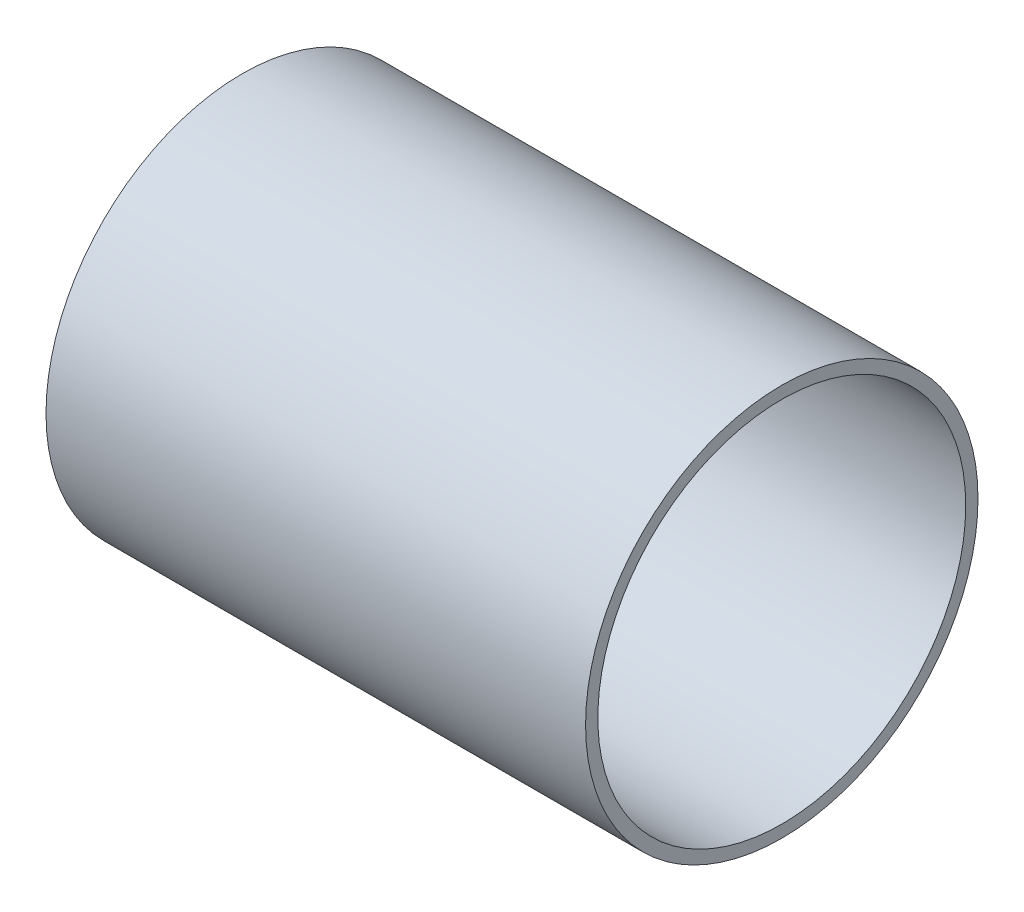
ISO-10303-21;
HEADER;
FILE_DESCRIPTION(('STEP AP214'),'2;1');
FILE_NAME('part.step','',(''),(''),'','','');
FILE_SCHEMA(('AUTOMOTIVE_DESIGN { 1 0 10303 214 1 1 1 1 }'));
ENDSEC;
DATA;
#1=APPLICATION_CONTEXT('core data for automotive mechanical design processes');
#2=APPLICATION_PROTOCOL_DEFINITION('international standard','automotive_design',2000,#1);
#3=PRODUCT_CONTEXT('',#1,'mechanical');
#4=PRODUCT('Part','Part','',(#3));
#5=PRODUCT_RELATED_PRODUCT_CATEGORY('part','',(#4));
#6=PRODUCT_DEFINITION_FORMATION('','',#4);
#7=PRODUCT_DEFINITION_CONTEXT('part definition',#1,'design');
#8=PRODUCT_DEFINITION('design','',#6,#7);
#9=PRODUCT_DEFINITION_SHAPE('','',#8);
#10=(LENGTH_UNIT() NAMED_UNIT(*) SI_UNIT(.MILLI.,.METRE.));
#11=(NAMED_UNIT(*) PLANE_ANGLE_UNIT() SI_UNIT($,.RADIAN.));
#12=(NAMED_UNIT(*) SI_UNIT($,.STERADIAN.) SOLID_ANGLE_UNIT());
#13=UNCERTAINTY_MEASURE_WITH_UNIT(LENGTH_MEASURE(1.E-05),#10,'distance_accuracy_value','');
#14=(GEOMETRIC_REPRESENTATION_CONTEXT(3) GLOBAL_UNCERTAINTY_ASSIGNED_CONTEXT((#13)) GLOBAL_UNIT_ASSIGNED_CONTEXT((#10,
#11,#12)) REPRESENTATION_CONTEXT('',''));
#15=CARTESIAN_POINT('',(0.,0.,0.));
#16=DIRECTION('',(0.,0.,1.));
#17=DIRECTION('',(1.,0.,0.));
#18=AXIS2_PLACEMENT_3D('',#15,#16,#17);
#19=CARTESIAN_POINT('',(139.7,0.,0.));
#20=DIRECTION('',(1.,0.,0.));
#21=DIRECTION('',(0.,0.,-1.));
#22=AXIS2_PLACEMENT_3D('',#19,#20,#21);
#23=PLANE('',#22);
#24=CARTESIAN_POINT('',(139.7,0.,0.));
#25=DIRECTION('',(1.,0.,0.));
#26=DIRECTION('',(0.,0.,-1.));
#27=AXIS2_PLACEMENT_3D('',#24,#25,#26);
#28=CIRCLE('',#27,50.8);
#29=CARTESIAN_POINT('',(139.7,0.,-50.8));
#30=VERTEX_POINT('',#29);
#31=EDGE_CURVE('E10',#30,#30,#28,.T.);
#32=ORIENTED_EDGE('',*,*,#31,.T.);
#33=EDGE_LOOP('',(#32));
#34=FACE_BOUND('',#33,.T.);
#35=CARTESIAN_POINT('',(139.7,0.,0.));
#36=DIRECTION('',(1.,0.,0.));
#37=DIRECTION('',(0.,0.,-1.));
#38=AXIS2_PLACEMENT_3D('',#35,#36,#37);
#39=CIRCLE('',#38,47.625);
#40=CARTESIAN_POINT('',(139.7,0.,-47.625));
#41=VERTEX_POINT('',#40);
#42=EDGE_CURVE('E44',#41,#41,#39,.T.);
#43=ORIENTED_EDGE('',*,*,#42,.F.);
#44=EDGE_LOOP('',(#43));
#45=FACE_BOUND('',#44,.T.);
#46=ADVANCED_FACE('F33',(#34,#45),#23,.T.);
#47=CARTESIAN_POINT('',(0.,0.,0.));
#48=DIRECTION('',(1.,0.,0.));
#49=DIRECTION('',(0.,0.,-1.));
#50=AXIS2_PLACEMENT_3D('',#47,#48,#49);
#51=PLANE('',#50);
#52=CARTESIAN_POINT('',(0.,0.,0.));
#53=DIRECTION('',(1.,0.,0.));
#54=DIRECTION('',(0.,0.,-1.));
#55=AXIS2_PLACEMENT_3D('',#52,#53,#54);
#56=CIRCLE('',#55,50.8);
#57=CARTESIAN_POINT('',(0.,0.,-50.8));
#58=VERTEX_POINT('',#57);
#59=EDGE_CURVE('E37',#58,#58,#56,.T.);
#60=ORIENTED_EDGE('',*,*,#59,.F.);
#61=EDGE_LOOP('',(#60));
#62=FACE_BOUND('',#61,.T.);
#63=CARTESIAN_POINT('',(0.,0.,0.));
#64=DIRECTION('',(1.,0.,0.));
#65=DIRECTION('',(0.,0.,-1.));
#66=AXIS2_PLACEMENT_3D('',#63,#64,#65);
#67=CIRCLE('',#66,47.625);
#68=CARTESIAN_POINT('',(0.,0.,-47.625));
#69=VERTEX_POINT('',#68);
#70=EDGE_CURVE('E46',#69,#69,#67,.T.);
#71=ORIENTED_EDGE('',*,*,#70,.T.);
#72=EDGE_LOOP('',(#71));
#73=FACE_BOUND('',#72,.T.);
#74=ADVANCED_FACE('F56',(#62,#73),#51,.F.);
#75=CARTESIAN_POINT('',(139.7,0.,0.));
#76=DIRECTION('',(-1.,0.,0.));
#77=DIRECTION('',(0.,0.,1.));
#78=AXIS2_PLACEMENT_3D('',#75,#76,#77);
#79=CYLINDRICAL_SURFACE('',#78,50.8);
#80=ORIENTED_EDGE('',*,*,#31,.F.);
#81=EDGE_LOOP('',(#80));
#82=FACE_BOUND('',#81,.T.);
#83=ORIENTED_EDGE('',*,*,#59,.T.);
#84=EDGE_LOOP('',(#83));
#85=FACE_BOUND('',#84,.T.);
#86=ADVANCED_FACE('F35',(#82,#85),#79,.T.);
#87=CARTESIAN_POINT('',(139.7,0.,0.));
#88=DIRECTION('',(-1.,0.,0.));
#89=DIRECTION('',(0.,0.,1.));
#90=AXIS2_PLACEMENT_3D('',#87,#88,#89);
#91=CYLINDRICAL_SURFACE('',#90,47.625);
#92=ORIENTED_EDGE('',*,*,#42,.T.);
#93=EDGE_LOOP('',(#92));
#94=FACE_BOUND('',#93,.T.);
#95=ORIENTED_EDGE('',*,*,#70,.F.);
#96=EDGE_LOOP('',(#95));
#97=FACE_BOUND('',#96,.T.);
#98=ADVANCED_FACE('F52',(#94,#97),#91,.F.);
#99=CLOSED_SHELL('',(#46,#74,#86,#98));
#100=MANIFOLD_SOLID_BREP('B2',#99);
#101=ADVANCED_BREP_SHAPE_REPRESENTATION('',(#18,#100),#14);
#102=SHAPE_DEFINITION_REPRESENTATION(#9,#101);
ENDSEC;
END-ISO-10303-21;
